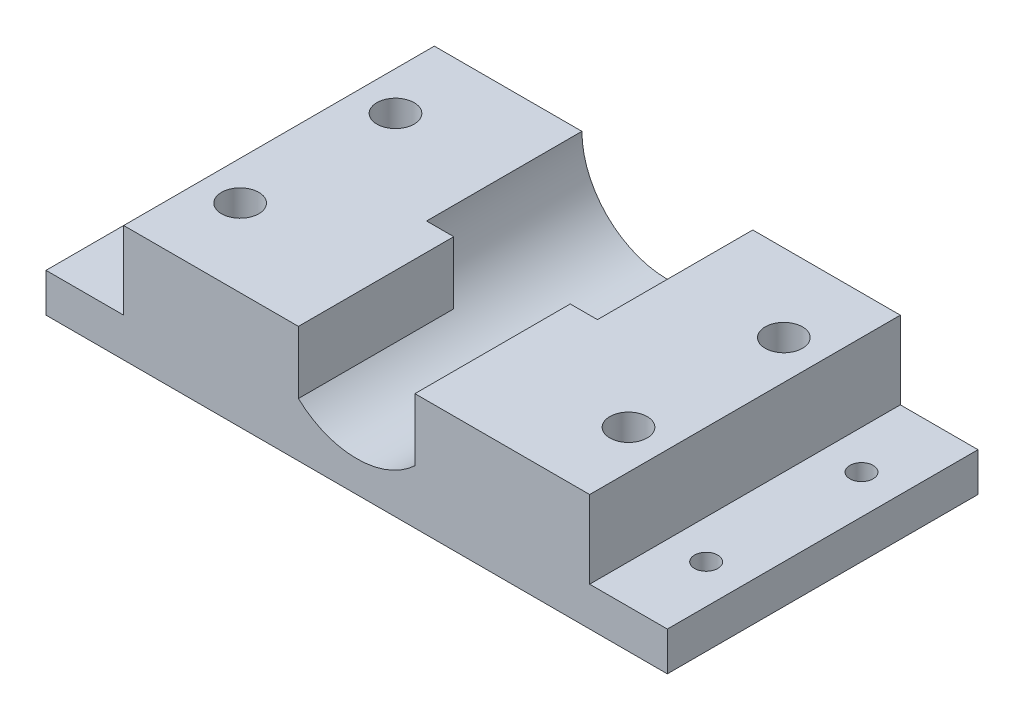
ISO-10303-21;
HEADER;
FILE_DESCRIPTION(('STEP AP214'),'2;1');
FILE_NAME('part.step','',(''),(''),'','','');
FILE_SCHEMA(('AUTOMOTIVE_DESIGN { 1 0 10303 214 1 1 1 1 }'));
ENDSEC;
DATA;
#1=APPLICATION_CONTEXT('core data for automotive mechanical design processes');
#2=APPLICATION_PROTOCOL_DEFINITION('international standard','automotive_design',2000,#1);
#3=PRODUCT_CONTEXT('',#1,'mechanical');
#4=PRODUCT('Part','Part','',(#3));
#5=PRODUCT_RELATED_PRODUCT_CATEGORY('part','',(#4));
#6=PRODUCT_DEFINITION_FORMATION('','',#4);
#7=PRODUCT_DEFINITION_CONTEXT('part definition',#1,'design');
#8=PRODUCT_DEFINITION('design','',#6,#7);
#9=PRODUCT_DEFINITION_SHAPE('','',#8);
#10=(LENGTH_UNIT() NAMED_UNIT(*) SI_UNIT(.MILLI.,.METRE.));
#11=(NAMED_UNIT(*) PLANE_ANGLE_UNIT() SI_UNIT($,.RADIAN.));
#12=(NAMED_UNIT(*) SI_UNIT($,.STERADIAN.) SOLID_ANGLE_UNIT());
#13=UNCERTAINTY_MEASURE_WITH_UNIT(LENGTH_MEASURE(1.E-05),#10,'distance_accuracy_value','');
#14=(GEOMETRIC_REPRESENTATION_CONTEXT(3) GLOBAL_UNCERTAINTY_ASSIGNED_CONTEXT((#13)) GLOBAL_UNIT_ASSIGNED_CONTEXT((#10,
#11,#12)) REPRESENTATION_CONTEXT('',''));
#15=CARTESIAN_POINT('',(0.,0.,0.));
#16=DIRECTION('',(0.,0.,1.));
#17=DIRECTION('',(1.,0.,0.));
#18=AXIS2_PLACEMENT_3D('',#15,#16,#17);
#19=CARTESIAN_POINT('',(0.,15.,40.));
#20=DIRECTION('',(0.,-1.,0.));
#21=DIRECTION('',(0.,0.,-1.));
#22=AXIS2_PLACEMENT_3D('',#19,#20,#21);
#23=PLANE('',#22);
#24=CARTESIAN_POINT('',(55.,15.,30.));
#25=DIRECTION('',(0.,1.,0.));
#26=DIRECTION('',(0.,0.,1.));
#27=AXIS2_PLACEMENT_3D('',#24,#25,#26);
#28=CIRCLE('',#27,2.4);
#29=CARTESIAN_POINT('',(55.,15.,32.4));
#30=VERTEX_POINT('',#29);
#31=EDGE_CURVE('E190',#30,#30,#28,.T.);
#32=ORIENTED_EDGE('',*,*,#31,.F.);
#33=EDGE_LOOP('',(#32));
#34=FACE_BOUND('',#33,.T.);
#35=CARTESIAN_POINT('',(55.,15.,10.));
#36=DIRECTION('',(0.,1.,0.));
#37=DIRECTION('',(0.,0.,1.));
#38=AXIS2_PLACEMENT_3D('',#35,#36,#37);
#39=CIRCLE('',#38,2.4);
#40=CARTESIAN_POINT('',(55.,15.,12.4));
#41=VERTEX_POINT('',#40);
#42=EDGE_CURVE('E182',#41,#41,#39,.T.);
#43=ORIENTED_EDGE('',*,*,#42,.F.);
#44=EDGE_LOOP('',(#43));
#45=FACE_BOUND('',#44,.T.);
#46=DIRECTION('',(-1.,0.,0.));
#47=VECTOR('',#46,1.);
#48=CARTESIAN_POINT('',(0.,15.,0.));
#49=LINE('',#48,#47);
#50=CARTESIAN_POINT('',(60.,15.,0.));
#51=VERTEX_POINT('',#50);
#52=CARTESIAN_POINT('',(41.,15.,0.));
#53=VERTEX_POINT('',#52);
#54=EDGE_CURVE('E288',#51,#53,#49,.T.);
#55=ORIENTED_EDGE('',*,*,#54,.T.);
#56=DIRECTION('',(0.,0.,1.));
#57=VECTOR('',#56,1.);
#58=CARTESIAN_POINT('',(41.,15.,0.));
#59=LINE('',#58,#57);
#60=CARTESIAN_POINT('',(41.,15.,20.));
#61=VERTEX_POINT('',#60);
#62=EDGE_CURVE('E156',#53,#61,#59,.T.);
#63=ORIENTED_EDGE('',*,*,#62,.T.);
#64=DIRECTION('',(-1.,0.,0.));
#65=VECTOR('',#64,1.);
#66=CARTESIAN_POINT('',(41.,15.,20.));
#67=LINE('',#66,#65);
#68=CARTESIAN_POINT('',(37.5,15.,20.));
#69=VERTEX_POINT('',#68);
#70=EDGE_CURVE('E152',#61,#69,#67,.T.);
#71=ORIENTED_EDGE('',*,*,#70,.T.);
#72=DIRECTION('',(0.,0.,1.));
#73=VECTOR('',#72,1.);
#74=CARTESIAN_POINT('',(37.5,15.,20.));
#75=LINE('',#74,#73);
#76=CARTESIAN_POINT('',(37.5,15.,40.));
#77=VERTEX_POINT('',#76);
#78=EDGE_CURVE('E137',#69,#77,#75,.T.);
#79=ORIENTED_EDGE('',*,*,#78,.T.);
#80=DIRECTION('',(-1.,0.,0.));
#81=VECTOR('',#80,1.);
#82=CARTESIAN_POINT('',(0.,15.,40.));
#83=LINE('',#82,#81);
#84=CARTESIAN_POINT('',(60.,15.,40.));
#85=VERTEX_POINT('',#84);
#86=EDGE_CURVE('E263',#85,#77,#83,.T.);
#87=ORIENTED_EDGE('',*,*,#86,.F.);
#88=DIRECTION('',(0.,0.,-1.));
#89=VECTOR('',#88,1.);
#90=CARTESIAN_POINT('',(60.,15.,40.));
#91=LINE('',#90,#89);
#92=EDGE_CURVE('E315',#85,#51,#91,.T.);
#93=ORIENTED_EDGE('',*,*,#92,.T.);
#94=EDGE_LOOP('',(#55,#63,#71,#79,#87,#93));
#95=FACE_BOUND('',#94,.T.);
#96=ADVANCED_FACE('F39',(#34,#45,#95),#23,.F.);
#97=CARTESIAN_POINT('',(60.,0.,40.));
#98=DIRECTION('',(0.,1.,0.));
#99=DIRECTION('',(0.,0.,1.));
#100=AXIS2_PLACEMENT_3D('',#97,#98,#99);
#101=PLANE('',#100);
#102=CARTESIAN_POINT('',(-5.,0.,30.));
#103=DIRECTION('',(0.,1.,0.));
#104=DIRECTION('',(-1.,0.,0.));
#105=AXIS2_PLACEMENT_3D('',#102,#103,#104);
#106=CIRCLE('',#105,1.5);
#107=CARTESIAN_POINT('',(-6.5,0.,30.));
#108=VERTEX_POINT('',#107);
#109=EDGE_CURVE('E226',#108,#108,#106,.T.);
#110=ORIENTED_EDGE('',*,*,#109,.T.);
#111=EDGE_LOOP('',(#110));
#112=FACE_BOUND('',#111,.T.);
#113=CARTESIAN_POINT('',(65.,0.,30.));
#114=DIRECTION('',(0.,1.,0.));
#115=DIRECTION('',(-1.,0.,0.));
#116=AXIS2_PLACEMENT_3D('',#113,#114,#115);
#117=CIRCLE('',#116,1.5);
#118=CARTESIAN_POINT('',(63.5,0.,30.));
#119=VERTEX_POINT('',#118);
#120=EDGE_CURVE('E218',#119,#119,#117,.T.);
#121=ORIENTED_EDGE('',*,*,#120,.T.);
#122=EDGE_LOOP('',(#121));
#123=FACE_BOUND('',#122,.T.);
#124=CARTESIAN_POINT('',(65.,0.,10.));
#125=DIRECTION('',(0.,1.,0.));
#126=DIRECTION('',(-1.,0.,0.));
#127=AXIS2_PLACEMENT_3D('',#124,#125,#126);
#128=CIRCLE('',#127,1.5);
#129=CARTESIAN_POINT('',(63.5,0.,10.));
#130=VERTEX_POINT('',#129);
#131=EDGE_CURVE('E209',#130,#130,#128,.T.);
#132=ORIENTED_EDGE('',*,*,#131,.T.);
#133=EDGE_LOOP('',(#132));
#134=FACE_BOUND('',#133,.T.);
#135=CARTESIAN_POINT('',(-5.,0.,10.));
#136=DIRECTION('',(0.,1.,0.));
#137=DIRECTION('',(-1.,0.,0.));
#138=AXIS2_PLACEMENT_3D('',#135,#136,#137);
#139=CIRCLE('',#138,1.5);
#140=CARTESIAN_POINT('',(-6.5,0.,10.));
#141=VERTEX_POINT('',#140);
#142=EDGE_CURVE('E233',#141,#141,#139,.T.);
#143=ORIENTED_EDGE('',*,*,#142,.T.);
#144=EDGE_LOOP('',(#143));
#145=FACE_BOUND('',#144,.T.);
#146=DIRECTION('',(1.,0.,0.));
#147=VECTOR('',#146,1.);
#148=CARTESIAN_POINT('',(60.,0.,0.));
#149=LINE('',#148,#147);
#150=CARTESIAN_POINT('',(-10.,0.,0.));
#151=VERTEX_POINT('',#150);
#152=CARTESIAN_POINT('',(70.,0.,0.));
#153=VERTEX_POINT('',#152);
#154=EDGE_CURVE('E248',#151,#153,#149,.T.);
#155=ORIENTED_EDGE('',*,*,#154,.T.);
#156=DIRECTION('',(0.,0.,-1.));
#157=VECTOR('',#156,1.);
#158=CARTESIAN_POINT('',(70.,0.,40.));
#159=LINE('',#158,#157);
#160=CARTESIAN_POINT('',(70.,0.,40.));
#161=VERTEX_POINT('',#160);
#162=EDGE_CURVE('E327',#161,#153,#159,.T.);
#163=ORIENTED_EDGE('',*,*,#162,.F.);
#164=DIRECTION('',(1.,0.,0.));
#165=VECTOR('',#164,1.);
#166=CARTESIAN_POINT('',(0.,0.,40.));
#167=LINE('',#166,#165);
#168=CARTESIAN_POINT('',(-10.,0.,40.));
#169=VERTEX_POINT('',#168);
#170=EDGE_CURVE('E249',#169,#161,#167,.T.);
#171=ORIENTED_EDGE('',*,*,#170,.F.);
#172=DIRECTION('',(0.,0.,-1.));
#173=VECTOR('',#172,1.);
#174=CARTESIAN_POINT('',(-10.,0.,40.));
#175=LINE('',#174,#173);
#176=EDGE_CURVE('E275',#169,#151,#175,.T.);
#177=ORIENTED_EDGE('',*,*,#176,.T.);
#178=EDGE_LOOP('',(#155,#163,#171,#177));
#179=FACE_BOUND('',#178,.T.);
#180=ADVANCED_FACE('F41',(#112,#123,#134,#145,#179),#101,.F.);
#181=CARTESIAN_POINT('',(70.,5.,40.));
#182=DIRECTION('',(-1.,0.,0.));
#183=DIRECTION('',(0.,0.,1.));
#184=AXIS2_PLACEMENT_3D('',#181,#182,#183);
#185=PLANE('',#184);
#186=DIRECTION('',(0.,1.,0.));
#187=VECTOR('',#186,1.);
#188=CARTESIAN_POINT('',(70.,5.,0.));
#189=LINE('',#188,#187);
#190=CARTESIAN_POINT('',(70.,5.,0.));
#191=VERTEX_POINT('',#190);
#192=EDGE_CURVE('E278',#153,#191,#189,.T.);
#193=ORIENTED_EDGE('',*,*,#192,.T.);
#194=DIRECTION('',(0.,0.,-1.));
#195=VECTOR('',#194,1.);
#196=CARTESIAN_POINT('',(70.,5.,40.));
#197=LINE('',#196,#195);
#198=CARTESIAN_POINT('',(70.,5.,40.));
#199=VERTEX_POINT('',#198);
#200=EDGE_CURVE('E323',#199,#191,#197,.T.);
#201=ORIENTED_EDGE('',*,*,#200,.F.);
#202=DIRECTION('',(0.,1.,0.));
#203=VECTOR('',#202,1.);
#204=CARTESIAN_POINT('',(70.,5.,40.));
#205=LINE('',#204,#203);
#206=EDGE_CURVE('E252',#161,#199,#205,.T.);
#207=ORIENTED_EDGE('',*,*,#206,.F.);
#208=ORIENTED_EDGE('',*,*,#162,.T.);
#209=EDGE_LOOP('',(#193,#201,#207,#208));
#210=FACE_BOUND('',#209,.T.);
#211=ADVANCED_FACE('F399',(#210),#185,.F.);
#212=CARTESIAN_POINT('',(60.,5.,40.));
#213=DIRECTION('',(0.,-1.,0.));
#214=DIRECTION('',(0.,0.,-1.));
#215=AXIS2_PLACEMENT_3D('',#212,#213,#214);
#216=PLANE('',#215);
#217=CARTESIAN_POINT('',(65.,5.00000000000001,30.));
#218=DIRECTION('',(0.,1.,0.));
#219=DIRECTION('',(-1.,0.,0.));
#220=AXIS2_PLACEMENT_3D('',#217,#218,#219);
#221=CIRCLE('',#220,1.5);
#222=CARTESIAN_POINT('',(63.5,5.00000000000001,30.));
#223=VERTEX_POINT('',#222);
#224=EDGE_CURVE('E222',#223,#223,#221,.T.);
#225=ORIENTED_EDGE('',*,*,#224,.F.);
#226=EDGE_LOOP('',(#225));
#227=FACE_BOUND('',#226,.T.);
#228=CARTESIAN_POINT('',(65.,5.00000000000001,10.));
#229=DIRECTION('',(0.,1.,0.));
#230=DIRECTION('',(-1.,0.,0.));
#231=AXIS2_PLACEMENT_3D('',#228,#229,#230);
#232=CIRCLE('',#231,1.5);
#233=CARTESIAN_POINT('',(63.5,5.00000000000001,10.));
#234=VERTEX_POINT('',#233);
#235=EDGE_CURVE('E214',#234,#234,#232,.T.);
#236=ORIENTED_EDGE('',*,*,#235,.F.);
#237=EDGE_LOOP('',(#236));
#238=FACE_BOUND('',#237,.T.);
#239=DIRECTION('',(-1.,0.,0.));
#240=VECTOR('',#239,1.);
#241=CARTESIAN_POINT('',(60.,5.,0.));
#242=LINE('',#241,#240);
#243=CARTESIAN_POINT('',(60.,5.,0.));
#244=VERTEX_POINT('',#243);
#245=EDGE_CURVE('E281',#191,#244,#242,.T.);
#246=ORIENTED_EDGE('',*,*,#245,.T.);
#247=DIRECTION('',(0.,0.,-1.));
#248=VECTOR('',#247,1.);
#249=CARTESIAN_POINT('',(60.,5.,40.));
#250=LINE('',#249,#248);
#251=CARTESIAN_POINT('',(60.,5.,40.));
#252=VERTEX_POINT('',#251);
#253=EDGE_CURVE('E319',#252,#244,#250,.T.);
#254=ORIENTED_EDGE('',*,*,#253,.F.);
#255=DIRECTION('',(-1.,0.,0.));
#256=VECTOR('',#255,1.);
#257=CARTESIAN_POINT('',(60.,5.,40.));
#258=LINE('',#257,#256);
#259=EDGE_CURVE('E256',#199,#252,#258,.T.);
#260=ORIENTED_EDGE('',*,*,#259,.F.);
#261=ORIENTED_EDGE('',*,*,#200,.T.);
#262=EDGE_LOOP('',(#246,#254,#260,#261));
#263=FACE_BOUND('',#262,.T.);
#264=ADVANCED_FACE('F412',(#227,#238,#263),#216,.F.);
#265=CARTESIAN_POINT('',(60.,15.,40.));
#266=DIRECTION('',(-1.,0.,0.));
#267=DIRECTION('',(0.,0.,1.));
#268=AXIS2_PLACEMENT_3D('',#265,#266,#267);
#269=PLANE('',#268);
#270=DIRECTION('',(0.,1.,0.));
#271=VECTOR('',#270,1.);
#272=CARTESIAN_POINT('',(60.,15.,0.));
#273=LINE('',#272,#271);
#274=EDGE_CURVE('E284',#244,#51,#273,.T.);
#275=ORIENTED_EDGE('',*,*,#274,.T.);
#276=ORIENTED_EDGE('',*,*,#92,.F.);
#277=DIRECTION('',(0.,1.,0.));
#278=VECTOR('',#277,1.);
#279=CARTESIAN_POINT('',(60.,15.,40.));
#280=LINE('',#279,#278);
#281=EDGE_CURVE('E259',#252,#85,#280,.T.);
#282=ORIENTED_EDGE('',*,*,#281,.F.);
#283=ORIENTED_EDGE('',*,*,#253,.T.);
#284=EDGE_LOOP('',(#275,#276,#282,#283));
#285=FACE_BOUND('',#284,.T.);
#286=ADVANCED_FACE('F406',(#285),#269,.F.);
#287=CARTESIAN_POINT('',(5.,15.,30.));
#288=DIRECTION('',(0.,1.,0.));
#289=DIRECTION('',(0.,0.,1.));
#290=AXIS2_PLACEMENT_3D('',#287,#288,#289);
#291=CIRCLE('',#290,2.4);
#292=CARTESIAN_POINT('',(5.,15.,32.4));
#293=VERTEX_POINT('',#292);
#294=EDGE_CURVE('E176',#293,#293,#291,.T.);
#295=ORIENTED_EDGE('',*,*,#294,.F.);
#296=EDGE_LOOP('',(#295));
#297=FACE_BOUND('',#296,.T.);
#298=CARTESIAN_POINT('',(5.,15.,10.));
#299=DIRECTION('',(0.,1.,0.));
#300=DIRECTION('',(0.,0.,1.));
#301=AXIS2_PLACEMENT_3D('',#298,#299,#300);
#302=CIRCLE('',#301,2.4);
#303=CARTESIAN_POINT('',(5.,15.,12.4));
#304=VERTEX_POINT('',#303);
#305=EDGE_CURVE('E181',#304,#304,#302,.T.);
#306=ORIENTED_EDGE('',*,*,#305,.F.);
#307=EDGE_LOOP('',(#306));
#308=FACE_BOUND('',#307,.T.);
#309=CARTESIAN_POINT('',(22.5,15.,40.));
#310=VERTEX_POINT('',#309);
#311=CARTESIAN_POINT('',(0.,15.,40.));
#312=VERTEX_POINT('',#311);
#313=EDGE_CURVE('E262',#310,#312,#83,.T.);
#314=ORIENTED_EDGE('',*,*,#313,.F.);
#315=DIRECTION('',(0.,0.,1.));
#316=VECTOR('',#315,1.);
#317=CARTESIAN_POINT('',(22.5,15.,20.));
#318=LINE('',#317,#316);
#319=CARTESIAN_POINT('',(22.5,15.,20.));
#320=VERTEX_POINT('',#319);
#321=EDGE_CURVE('E169',#320,#310,#318,.T.);
#322=ORIENTED_EDGE('',*,*,#321,.F.);
#323=DIRECTION('',(-1.,0.,0.));
#324=VECTOR('',#323,1.);
#325=CARTESIAN_POINT('',(19.,15.,20.));
#326=LINE('',#325,#324);
#327=CARTESIAN_POINT('',(19.,15.,20.));
#328=VERTEX_POINT('',#327);
#329=EDGE_CURVE('E165',#320,#328,#326,.T.);
#330=ORIENTED_EDGE('',*,*,#329,.T.);
#331=DIRECTION('',(0.,0.,1.));
#332=VECTOR('',#331,1.);
#333=CARTESIAN_POINT('',(19.,15.,0.));
#334=LINE('',#333,#332);
#335=CARTESIAN_POINT('',(19.,15.,0.));
#336=VERTEX_POINT('',#335);
#337=EDGE_CURVE('E243',#328,#336,#334,.F.);
#338=ORIENTED_EDGE('',*,*,#337,.T.);
#339=CARTESIAN_POINT('',(0.,15.,0.));
#340=VERTEX_POINT('',#339);
#341=EDGE_CURVE('E287',#336,#340,#49,.T.);
#342=ORIENTED_EDGE('',*,*,#341,.T.);
#343=DIRECTION('',(0.,0.,-1.));
#344=VECTOR('',#343,1.);
#345=CARTESIAN_POINT('',(0.,15.,40.));
#346=LINE('',#345,#344);
#347=EDGE_CURVE('E311',#312,#340,#346,.T.);
#348=ORIENTED_EDGE('',*,*,#347,.F.);
#349=EDGE_LOOP('',(#314,#322,#330,#338,#342,#348));
#350=FACE_BOUND('',#349,.T.);
#351=ADVANCED_FACE('F348',(#297,#308,#350),#23,.F.);
#352=CARTESIAN_POINT('',(0.,15.,40.));
#353=DIRECTION('',(1.,0.,0.));
#354=DIRECTION('',(0.,1.,0.));
#355=AXIS2_PLACEMENT_3D('',#352,#353,#354);
#356=PLANE('',#355);
#357=DIRECTION('',(0.,-1.,0.));
#358=VECTOR('',#357,1.);
#359=CARTESIAN_POINT('',(0.,15.,0.));
#360=LINE('',#359,#358);
#361=CARTESIAN_POINT('',(0.,5.,0.));
#362=VERTEX_POINT('',#361);
#363=EDGE_CURVE('E291',#340,#362,#360,.T.);
#364=ORIENTED_EDGE('',*,*,#363,.T.);
#365=DIRECTION('',(0.,0.,-1.));
#366=VECTOR('',#365,1.);
#367=CARTESIAN_POINT('',(0.,5.,40.));
#368=LINE('',#367,#366);
#369=CARTESIAN_POINT('',(0.,5.,40.));
#370=VERTEX_POINT('',#369);
#371=EDGE_CURVE('E307',#370,#362,#368,.T.);
#372=ORIENTED_EDGE('',*,*,#371,.F.);
#373=DIRECTION('',(0.,-1.,0.));
#374=VECTOR('',#373,1.);
#375=CARTESIAN_POINT('',(0.,15.,40.));
#376=LINE('',#375,#374);
#377=EDGE_CURVE('E266',#312,#370,#376,.T.);
#378=ORIENTED_EDGE('',*,*,#377,.F.);
#379=ORIENTED_EDGE('',*,*,#347,.T.);
#380=EDGE_LOOP('',(#364,#372,#378,#379));
#381=FACE_BOUND('',#380,.T.);
#382=ADVANCED_FACE('F354',(#381),#356,.F.);
#383=CARTESIAN_POINT('',(0.,5.,40.));
#384=DIRECTION('',(0.,-1.,0.));
#385=DIRECTION('',(1.,0.,0.));
#386=AXIS2_PLACEMENT_3D('',#383,#384,#385);
#387=PLANE('',#386);
#388=CARTESIAN_POINT('',(-5.,5.,30.));
#389=DIRECTION('',(0.,1.,0.));
#390=DIRECTION('',(-1.,0.,0.));
#391=AXIS2_PLACEMENT_3D('',#388,#389,#390);
#392=CIRCLE('',#391,1.5);
#393=CARTESIAN_POINT('',(-6.5,5.,30.));
#394=VERTEX_POINT('',#393);
#395=EDGE_CURVE('E205',#394,#394,#392,.T.);
#396=ORIENTED_EDGE('',*,*,#395,.F.);
#397=EDGE_LOOP('',(#396));
#398=FACE_BOUND('',#397,.T.);
#399=CARTESIAN_POINT('',(-5.,5.,10.));
#400=DIRECTION('',(0.,1.,0.));
#401=DIRECTION('',(-1.,0.,0.));
#402=AXIS2_PLACEMENT_3D('',#399,#400,#401);
#403=CIRCLE('',#402,1.5);
#404=CARTESIAN_POINT('',(-6.5,5.,10.));
#405=VERTEX_POINT('',#404);
#406=EDGE_CURVE('E213',#405,#405,#403,.T.);
#407=ORIENTED_EDGE('',*,*,#406,.F.);
#408=EDGE_LOOP('',(#407));
#409=FACE_BOUND('',#408,.T.);
#410=DIRECTION('',(-1.,0.,0.));
#411=VECTOR('',#410,1.);
#412=CARTESIAN_POINT('',(0.,5.,0.));
#413=LINE('',#412,#411);
#414=CARTESIAN_POINT('',(-10.,5.,0.));
#415=VERTEX_POINT('',#414);
#416=EDGE_CURVE('E294',#362,#415,#413,.T.);
#417=ORIENTED_EDGE('',*,*,#416,.T.);
#418=DIRECTION('',(0.,0.,-1.));
#419=VECTOR('',#418,1.);
#420=CARTESIAN_POINT('',(-10.,5.,40.));
#421=LINE('',#420,#419);
#422=CARTESIAN_POINT('',(-10.,5.,40.));
#423=VERTEX_POINT('',#422);
#424=EDGE_CURVE('E303',#423,#415,#421,.T.);
#425=ORIENTED_EDGE('',*,*,#424,.F.);
#426=DIRECTION('',(-1.,0.,0.));
#427=VECTOR('',#426,1.);
#428=CARTESIAN_POINT('',(0.,5.,40.));
#429=LINE('',#428,#427);
#430=EDGE_CURVE('E269',#370,#423,#429,.T.);
#431=ORIENTED_EDGE('',*,*,#430,.F.);
#432=ORIENTED_EDGE('',*,*,#371,.T.);
#433=EDGE_LOOP('',(#417,#425,#431,#432));
#434=FACE_BOUND('',#433,.T.);
#435=ADVANCED_FACE('F361',(#398,#409,#434),#387,.F.);
#436=CARTESIAN_POINT('',(-10.,0.,40.));
#437=DIRECTION('',(1.,0.,0.));
#438=DIRECTION('',(0.,0.,-1.));
#439=AXIS2_PLACEMENT_3D('',#436,#437,#438);
#440=PLANE('',#439);
#441=DIRECTION('',(0.,-1.,0.));
#442=VECTOR('',#441,1.);
#443=CARTESIAN_POINT('',(-10.,0.,0.));
#444=LINE('',#443,#442);
#445=EDGE_CURVE('E253',#415,#151,#444,.T.);
#446=ORIENTED_EDGE('',*,*,#445,.T.);
#447=ORIENTED_EDGE('',*,*,#176,.F.);
#448=DIRECTION('',(0.,-1.,0.));
#449=VECTOR('',#448,1.);
#450=CARTESIAN_POINT('',(-10.,0.,40.));
#451=LINE('',#450,#449);
#452=EDGE_CURVE('E272',#423,#169,#451,.T.);
#453=ORIENTED_EDGE('',*,*,#452,.F.);
#454=ORIENTED_EDGE('',*,*,#424,.T.);
#455=EDGE_LOOP('',(#446,#447,#453,#454));
#456=FACE_BOUND('',#455,.T.);
#457=ADVANCED_FACE('F365',(#456),#440,.F.);
#458=CARTESIAN_POINT('',(0.,0.,40.));
#459=DIRECTION('',(0.,0.,-1.));
#460=DIRECTION('',(-1.,0.,0.));
#461=AXIS2_PLACEMENT_3D('',#458,#459,#460);
#462=PLANE('',#461);
#463=ORIENTED_EDGE('',*,*,#86,.T.);
#464=DIRECTION('',(0.,-1.,0.));
#465=VECTOR('',#464,1.);
#466=CARTESIAN_POINT('',(37.5,15.,40.));
#467=LINE('',#466,#465);
#468=CARTESIAN_POINT('',(37.5,6.95326153028446,40.));
#469=VERTEX_POINT('',#468);
#470=EDGE_CURVE('E142',#77,#469,#467,.T.);
#471=ORIENTED_EDGE('',*,*,#470,.T.);
#472=CARTESIAN_POINT('',(30.,15.,40.));
#473=DIRECTION('',(0.,0.,1.));
#474=DIRECTION('',(1.,0.,0.));
#475=AXIS2_PLACEMENT_3D('',#472,#473,#474);
#476=CIRCLE('',#475,11.);
#477=CARTESIAN_POINT('',(22.5,6.95326153028446,40.));
#478=VERTEX_POINT('',#477);
#479=EDGE_CURVE('E237',#478,#469,#476,.T.);
#480=ORIENTED_EDGE('',*,*,#479,.F.);
#481=DIRECTION('',(0.,1.,0.));
#482=VECTOR('',#481,1.);
#483=CARTESIAN_POINT('',(22.5,15.,40.));
#484=LINE('',#483,#482);
#485=EDGE_CURVE('E147',#478,#310,#484,.T.);
#486=ORIENTED_EDGE('',*,*,#485,.T.);
#487=ORIENTED_EDGE('',*,*,#313,.T.);
#488=ORIENTED_EDGE('',*,*,#377,.T.);
#489=ORIENTED_EDGE('',*,*,#430,.T.);
#490=ORIENTED_EDGE('',*,*,#452,.T.);
#491=ORIENTED_EDGE('',*,*,#170,.T.);
#492=ORIENTED_EDGE('',*,*,#206,.T.);
#493=ORIENTED_EDGE('',*,*,#259,.T.);
#494=ORIENTED_EDGE('',*,*,#281,.T.);
#495=EDGE_LOOP('',(#463,#471,#480,#486,#487,#488,#489,#490,#491,#492,#493,#494));
#496=FACE_BOUND('',#495,.T.);
#497=ADVANCED_FACE('F369',(#496),#462,.F.);
#498=CARTESIAN_POINT('',(0.,0.,0.));
#499=DIRECTION('',(0.,0.,-1.));
#500=DIRECTION('',(-1.,0.,0.));
#501=AXIS2_PLACEMENT_3D('',#498,#499,#500);
#502=PLANE('',#501);
#503=CARTESIAN_POINT('',(30.,15.,0.));
#504=DIRECTION('',(0.,0.,-1.));
#505=DIRECTION('',(-1.,0.,0.));
#506=AXIS2_PLACEMENT_3D('',#503,#504,#505);
#507=CIRCLE('',#506,11.);
#508=EDGE_CURVE('E331',#53,#336,#507,.T.);
#509=ORIENTED_EDGE('',*,*,#508,.F.);
#510=ORIENTED_EDGE('',*,*,#54,.F.);
#511=ORIENTED_EDGE('',*,*,#274,.F.);
#512=ORIENTED_EDGE('',*,*,#245,.F.);
#513=ORIENTED_EDGE('',*,*,#192,.F.);
#514=ORIENTED_EDGE('',*,*,#154,.F.);
#515=ORIENTED_EDGE('',*,*,#445,.F.);
#516=ORIENTED_EDGE('',*,*,#416,.F.);
#517=ORIENTED_EDGE('',*,*,#363,.F.);
#518=ORIENTED_EDGE('',*,*,#341,.F.);
#519=EDGE_LOOP('',(#509,#510,#511,#512,#513,#514,#515,#516,#517,#518));
#520=FACE_BOUND('',#519,.T.);
#521=ADVANCED_FACE('F357',(#520),#502,.T.);
#522=CARTESIAN_POINT('',(30.,15.,0.));
#523=DIRECTION('',(0.,0.,1.));
#524=DIRECTION('',(1.,0.,0.));
#525=AXIS2_PLACEMENT_3D('',#522,#523,#524);
#526=CYLINDRICAL_SURFACE('',#525,11.);
#527=ORIENTED_EDGE('',*,*,#479,.T.);
#528=DIRECTION('',(0.,0.,1.));
#529=VECTOR('',#528,1.);
#530=CARTESIAN_POINT('',(37.5,6.95326153028446,0.));
#531=LINE('',#530,#529);
#532=CARTESIAN_POINT('',(37.5,6.95326153028446,20.));
#533=VERTEX_POINT('',#532);
#534=EDGE_CURVE('E11',#469,#533,#531,.F.);
#535=ORIENTED_EDGE('',*,*,#534,.T.);
#536=CARTESIAN_POINT('',(30.,15.,20.));
#537=DIRECTION('',(0.,0.,-1.));
#538=DIRECTION('',(-1.,0.,0.));
#539=AXIS2_PLACEMENT_3D('',#536,#537,#538);
#540=CIRCLE('',#539,11.);
#541=EDGE_CURVE('E48',#533,#61,#540,.F.);
#542=ORIENTED_EDGE('',*,*,#541,.T.);
#543=ORIENTED_EDGE('',*,*,#62,.F.);
#544=ORIENTED_EDGE('',*,*,#508,.T.);
#545=ORIENTED_EDGE('',*,*,#337,.F.);
#546=CARTESIAN_POINT('',(30.,15.,20.));
#547=DIRECTION('',(0.,0.,1.));
#548=DIRECTION('',(1.,0.,0.));
#549=AXIS2_PLACEMENT_3D('',#546,#547,#548);
#550=CIRCLE('',#549,11.);
#551=CARTESIAN_POINT('',(22.5,6.95326153028446,20.));
#552=VERTEX_POINT('',#551);
#553=EDGE_CURVE('E335',#552,#328,#550,.F.);
#554=ORIENTED_EDGE('',*,*,#553,.F.);
#555=DIRECTION('',(0.,0.,1.));
#556=VECTOR('',#555,1.);
#557=CARTESIAN_POINT('',(22.5,6.95326153028446,0.));
#558=LINE('',#557,#556);
#559=EDGE_CURVE('E339',#552,#478,#558,.T.);
#560=ORIENTED_EDGE('',*,*,#559,.T.);
#561=EDGE_LOOP('',(#527,#535,#542,#543,#544,#545,#554,#560));
#562=FACE_BOUND('',#561,.T.);
#563=ADVANCED_FACE('F379',(#562),#526,.F.);
#564=CARTESIAN_POINT('',(-5.,0.,10.));
#565=DIRECTION('',(0.,1.,0.));
#566=DIRECTION('',(-1.,0.,0.));
#567=AXIS2_PLACEMENT_3D('',#564,#565,#566);
#568=CYLINDRICAL_SURFACE('',#567,1.5);
#569=ORIENTED_EDGE('',*,*,#142,.F.);
#570=EDGE_LOOP('',(#569));
#571=FACE_BOUND('',#570,.T.);
#572=ORIENTED_EDGE('',*,*,#406,.T.);
#573=EDGE_LOOP('',(#572));
#574=FACE_BOUND('',#573,.T.);
#575=ADVANCED_FACE('F443',(#571,#574),#568,.F.);
#576=CARTESIAN_POINT('',(-5.,0.,30.));
#577=DIRECTION('',(0.,1.,0.));
#578=DIRECTION('',(-1.,0.,0.));
#579=AXIS2_PLACEMENT_3D('',#576,#577,#578);
#580=CYLINDRICAL_SURFACE('',#579,1.5);
#581=ORIENTED_EDGE('',*,*,#109,.F.);
#582=EDGE_LOOP('',(#581));
#583=FACE_BOUND('',#582,.T.);
#584=ORIENTED_EDGE('',*,*,#395,.T.);
#585=EDGE_LOOP('',(#584));
#586=FACE_BOUND('',#585,.T.);
#587=ADVANCED_FACE('F438',(#583,#586),#580,.F.);
#588=CARTESIAN_POINT('',(65.,0.,10.));
#589=DIRECTION('',(0.,1.,0.));
#590=DIRECTION('',(-1.,0.,0.));
#591=AXIS2_PLACEMENT_3D('',#588,#589,#590);
#592=CYLINDRICAL_SURFACE('',#591,1.5);
#593=ORIENTED_EDGE('',*,*,#131,.F.);
#594=EDGE_LOOP('',(#593));
#595=FACE_BOUND('',#594,.T.);
#596=ORIENTED_EDGE('',*,*,#235,.T.);
#597=EDGE_LOOP('',(#596));
#598=FACE_BOUND('',#597,.T.);
#599=ADVANCED_FACE('F431',(#595,#598),#592,.F.);
#600=CARTESIAN_POINT('',(65.,0.,30.));
#601=DIRECTION('',(0.,1.,0.));
#602=DIRECTION('',(-1.,0.,0.));
#603=AXIS2_PLACEMENT_3D('',#600,#601,#602);
#604=CYLINDRICAL_SURFACE('',#603,1.5);
#605=ORIENTED_EDGE('',*,*,#120,.F.);
#606=EDGE_LOOP('',(#605));
#607=FACE_BOUND('',#606,.T.);
#608=ORIENTED_EDGE('',*,*,#224,.T.);
#609=EDGE_LOOP('',(#608));
#610=FACE_BOUND('',#609,.T.);
#611=ADVANCED_FACE('F421',(#607,#610),#604,.F.);
#612=CARTESIAN_POINT('',(5.,9.,10.));
#613=DIRECTION('',(0.,1.,0.));
#614=DIRECTION('',(0.,0.,1.));
#615=AXIS2_PLACEMENT_3D('',#612,#613,#614);
#616=CYLINDRICAL_SURFACE('',#615,2.4);
#617=CARTESIAN_POINT('',(5.,9.,10.));
#618=DIRECTION('',(0.,1.,0.));
#619=DIRECTION('',(0.,0.,1.));
#620=AXIS2_PLACEMENT_3D('',#617,#618,#619);
#621=CIRCLE('',#620,2.4);
#622=CARTESIAN_POINT('',(5.,9.,12.4));
#623=VERTEX_POINT('',#622);
#624=EDGE_CURVE('E201',#623,#623,#621,.T.);
#625=ORIENTED_EDGE('',*,*,#624,.F.);
#626=EDGE_LOOP('',(#625));
#627=FACE_BOUND('',#626,.T.);
#628=ORIENTED_EDGE('',*,*,#305,.T.);
#629=EDGE_LOOP('',(#628));
#630=FACE_BOUND('',#629,.T.);
#631=ADVANCED_FACE('F418',(#627,#630),#616,.F.);
#632=CARTESIAN_POINT('',(5.,9.,10.));
#633=DIRECTION('',(0.,1.,0.));
#634=DIRECTION('',(0.,0.,1.));
#635=AXIS2_PLACEMENT_3D('',#632,#633,#634);
#636=PLANE('',#635);
#637=ORIENTED_EDGE('',*,*,#624,.T.);
#638=EDGE_LOOP('',(#637));
#639=FACE_BOUND('',#638,.T.);
#640=ADVANCED_FACE('F420',(#639),#636,.T.);
#641=CARTESIAN_POINT('',(5.,9.,30.));
#642=DIRECTION('',(0.,1.,0.));
#643=DIRECTION('',(0.,0.,1.));
#644=AXIS2_PLACEMENT_3D('',#641,#642,#643);
#645=CYLINDRICAL_SURFACE('',#644,2.4);
#646=CARTESIAN_POINT('',(5.,9.,30.));
#647=DIRECTION('',(0.,1.,0.));
#648=DIRECTION('',(0.,0.,1.));
#649=AXIS2_PLACEMENT_3D('',#646,#647,#648);
#650=CIRCLE('',#649,2.4);
#651=CARTESIAN_POINT('',(5.,9.,32.4));
#652=VERTEX_POINT('',#651);
#653=EDGE_CURVE('E194',#652,#652,#650,.T.);
#654=ORIENTED_EDGE('',*,*,#653,.F.);
#655=EDGE_LOOP('',(#654));
#656=FACE_BOUND('',#655,.T.);
#657=ORIENTED_EDGE('',*,*,#294,.T.);
#658=EDGE_LOOP('',(#657));
#659=FACE_BOUND('',#658,.T.);
#660=ADVANCED_FACE('F428',(#656,#659),#645,.F.);
#661=CARTESIAN_POINT('',(5.,9.,30.));
#662=DIRECTION('',(0.,1.,0.));
#663=DIRECTION('',(0.,0.,1.));
#664=AXIS2_PLACEMENT_3D('',#661,#662,#663);
#665=PLANE('',#664);
#666=ORIENTED_EDGE('',*,*,#653,.T.);
#667=EDGE_LOOP('',(#666));
#668=FACE_BOUND('',#667,.T.);
#669=ADVANCED_FACE('F520',(#668),#665,.T.);
#670=CARTESIAN_POINT('',(55.,9.,10.));
#671=DIRECTION('',(0.,1.,0.));
#672=DIRECTION('',(0.,0.,1.));
#673=AXIS2_PLACEMENT_3D('',#670,#671,#672);
#674=CYLINDRICAL_SURFACE('',#673,2.4);
#675=CARTESIAN_POINT('',(55.,9.,10.));
#676=DIRECTION('',(0.,1.,0.));
#677=DIRECTION('',(0.,0.,1.));
#678=AXIS2_PLACEMENT_3D('',#675,#676,#677);
#679=CIRCLE('',#678,2.4);
#680=CARTESIAN_POINT('',(55.,9.,12.4));
#681=VERTEX_POINT('',#680);
#682=EDGE_CURVE('E177',#681,#681,#679,.T.);
#683=ORIENTED_EDGE('',*,*,#682,.F.);
#684=EDGE_LOOP('',(#683));
#685=FACE_BOUND('',#684,.T.);
#686=ORIENTED_EDGE('',*,*,#42,.T.);
#687=EDGE_LOOP('',(#686));
#688=FACE_BOUND('',#687,.T.);
#689=ADVANCED_FACE('F529',(#685,#688),#674,.F.);
#690=CARTESIAN_POINT('',(55.,9.,10.));
#691=DIRECTION('',(0.,1.,0.));
#692=DIRECTION('',(0.,0.,1.));
#693=AXIS2_PLACEMENT_3D('',#690,#691,#692);
#694=PLANE('',#693);
#695=ORIENTED_EDGE('',*,*,#682,.T.);
#696=EDGE_LOOP('',(#695));
#697=FACE_BOUND('',#696,.T.);
#698=ADVANCED_FACE('F539',(#697),#694,.T.);
#699=CARTESIAN_POINT('',(55.,9.,30.));
#700=DIRECTION('',(0.,1.,0.));
#701=DIRECTION('',(0.,0.,1.));
#702=AXIS2_PLACEMENT_3D('',#699,#700,#701);
#703=CYLINDRICAL_SURFACE('',#702,2.4);
#704=CARTESIAN_POINT('',(55.,9.,30.));
#705=DIRECTION('',(0.,1.,0.));
#706=DIRECTION('',(0.,0.,1.));
#707=AXIS2_PLACEMENT_3D('',#704,#705,#706);
#708=CIRCLE('',#707,2.4);
#709=CARTESIAN_POINT('',(55.,9.,32.4));
#710=VERTEX_POINT('',#709);
#711=EDGE_CURVE('E186',#710,#710,#708,.T.);
#712=ORIENTED_EDGE('',*,*,#711,.F.);
#713=EDGE_LOOP('',(#712));
#714=FACE_BOUND('',#713,.T.);
#715=ORIENTED_EDGE('',*,*,#31,.T.);
#716=EDGE_LOOP('',(#715));
#717=FACE_BOUND('',#716,.T.);
#718=ADVANCED_FACE('F389',(#714,#717),#703,.F.);
#719=CARTESIAN_POINT('',(55.,9.,30.));
#720=DIRECTION('',(0.,1.,0.));
#721=DIRECTION('',(0.,0.,1.));
#722=AXIS2_PLACEMENT_3D('',#719,#720,#721);
#723=PLANE('',#722);
#724=ORIENTED_EDGE('',*,*,#711,.T.);
#725=EDGE_LOOP('',(#724));
#726=FACE_BOUND('',#725,.T.);
#727=ADVANCED_FACE('F382',(#726),#723,.T.);
#728=CARTESIAN_POINT('',(22.5,15.,20.));
#729=DIRECTION('',(1.,0.,0.));
#730=DIRECTION('',(0.,1.,0.));
#731=AXIS2_PLACEMENT_3D('',#728,#729,#730);
#732=PLANE('',#731);
#733=ORIENTED_EDGE('',*,*,#559,.F.);
#734=DIRECTION('',(0.,1.,0.));
#735=VECTOR('',#734,1.);
#736=CARTESIAN_POINT('',(22.5,15.,20.));
#737=LINE('',#736,#735);
#738=EDGE_CURVE('E162',#552,#320,#737,.T.);
#739=ORIENTED_EDGE('',*,*,#738,.T.);
#740=ORIENTED_EDGE('',*,*,#321,.T.);
#741=ORIENTED_EDGE('',*,*,#485,.F.);
#742=EDGE_LOOP('',(#733,#739,#740,#741));
#743=FACE_BOUND('',#742,.T.);
#744=ADVANCED_FACE('F380',(#743),#732,.T.);
#745=CARTESIAN_POINT('',(0.,0.,20.));
#746=DIRECTION('',(0.,0.,1.));
#747=DIRECTION('',(1.,0.,0.));
#748=AXIS2_PLACEMENT_3D('',#745,#746,#747);
#749=PLANE('',#748);
#750=ORIENTED_EDGE('',*,*,#738,.F.);
#751=ORIENTED_EDGE('',*,*,#553,.T.);
#752=ORIENTED_EDGE('',*,*,#329,.F.);
#753=EDGE_LOOP('',(#750,#751,#752));
#754=FACE_BOUND('',#753,.T.);
#755=ADVANCED_FACE('F377',(#754),#749,.F.);
#756=CARTESIAN_POINT('',(37.5,15.,20.));
#757=DIRECTION('',(-1.,0.,0.));
#758=DIRECTION('',(0.,0.,1.));
#759=AXIS2_PLACEMENT_3D('',#756,#757,#758);
#760=PLANE('',#759);
#761=ORIENTED_EDGE('',*,*,#534,.F.);
#762=ORIENTED_EDGE('',*,*,#470,.F.);
#763=ORIENTED_EDGE('',*,*,#78,.F.);
#764=DIRECTION('',(0.,-1.,0.));
#765=VECTOR('',#764,1.);
#766=CARTESIAN_POINT('',(37.5,15.,20.));
#767=LINE('',#766,#765);
#768=EDGE_CURVE('E140',#69,#533,#767,.T.);
#769=ORIENTED_EDGE('',*,*,#768,.T.);
#770=EDGE_LOOP('',(#761,#762,#763,#769));
#771=FACE_BOUND('',#770,.T.);
#772=ADVANCED_FACE('F139',(#771),#760,.T.);
#773=CARTESIAN_POINT('',(0.,0.,20.));
#774=DIRECTION('',(0.,0.,-1.));
#775=DIRECTION('',(-1.,0.,0.));
#776=AXIS2_PLACEMENT_3D('',#773,#774,#775);
#777=PLANE('',#776);
#778=ORIENTED_EDGE('',*,*,#541,.F.);
#779=ORIENTED_EDGE('',*,*,#768,.F.);
#780=ORIENTED_EDGE('',*,*,#70,.F.);
#781=EDGE_LOOP('',(#778,#779,#780));
#782=FACE_BOUND('',#781,.T.);
#783=ADVANCED_FACE('F151',(#782),#777,.T.);
#784=CLOSED_SHELL('',(#96,#180,#211,#264,#286,#351,#382,#435,#457,#497,#521,#563,#575,#587,#599,
#611,#631,#640,#660,#669,#689,#698,#718,#727,#744,#755,#772,#783));
#785=MANIFOLD_SOLID_BREP('B2',#784);
#786=ADVANCED_BREP_SHAPE_REPRESENTATION('',(#18,#785),#14);
#787=SHAPE_DEFINITION_REPRESENTATION(#9,#786);
ENDSEC;
END-ISO-10303-21;
